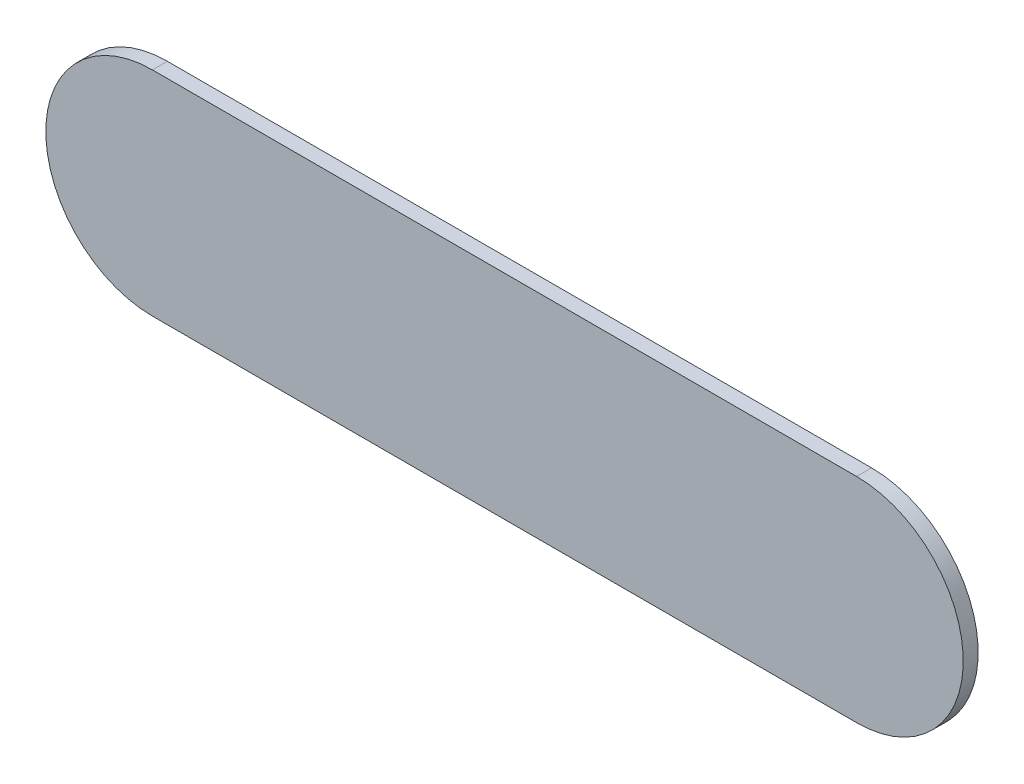
ISO-10303-21;
HEADER;
FILE_DESCRIPTION(('STEP AP214'),'2;1');
FILE_NAME('part.step','',(''),(''),'','','');
FILE_SCHEMA(('AUTOMOTIVE_DESIGN { 1 0 10303 214 1 1 1 1 }'));
ENDSEC;
DATA;
#1=APPLICATION_CONTEXT('core data for automotive mechanical design processes');
#2=APPLICATION_PROTOCOL_DEFINITION('international standard','automotive_design',2000,#1);
#3=PRODUCT_CONTEXT('',#1,'mechanical');
#4=PRODUCT('Part','Part','',(#3));
#5=PRODUCT_RELATED_PRODUCT_CATEGORY('part','',(#4));
#6=PRODUCT_DEFINITION_FORMATION('','',#4);
#7=PRODUCT_DEFINITION_CONTEXT('part definition',#1,'design');
#8=PRODUCT_DEFINITION('design','',#6,#7);
#9=PRODUCT_DEFINITION_SHAPE('','',#8);
#10=(LENGTH_UNIT() NAMED_UNIT(*) SI_UNIT(.MILLI.,.METRE.));
#11=(NAMED_UNIT(*) PLANE_ANGLE_UNIT() SI_UNIT($,.RADIAN.));
#12=(NAMED_UNIT(*) SI_UNIT($,.STERADIAN.) SOLID_ANGLE_UNIT());
#13=UNCERTAINTY_MEASURE_WITH_UNIT(LENGTH_MEASURE(1.E-05),#10,'distance_accuracy_value','');
#14=(GEOMETRIC_REPRESENTATION_CONTEXT(3) GLOBAL_UNCERTAINTY_ASSIGNED_CONTEXT((#13)) GLOBAL_UNIT_ASSIGNED_CONTEXT((#10,
#11,#12)) REPRESENTATION_CONTEXT('',''));
#15=CARTESIAN_POINT('',(0.,0.,0.));
#16=DIRECTION('',(0.,0.,1.));
#17=DIRECTION('',(1.,0.,0.));
#18=AXIS2_PLACEMENT_3D('',#15,#16,#17);
#19=CARTESIAN_POINT('',(123.444,-99.945,0.));
#20=DIRECTION('',(0.,0.,1.));
#21=DIRECTION('',(1.,0.,0.));
#22=AXIS2_PLACEMENT_3D('',#19,#20,#21);
#23=PLANE('',#22);
#24=DIRECTION('',(1.,0.,0.));
#25=VECTOR('',#24,1.);
#26=CARTESIAN_POINT('',(123.444,-99.945,0.));
#27=LINE('',#26,#25);
#28=CARTESIAN_POINT('',(123.444,-99.945,0.));
#29=VERTEX_POINT('',#28);
#30=CARTESIAN_POINT('',(125.095,-99.945,0.));
#31=VERTEX_POINT('',#30);
#32=EDGE_CURVE('E70',#29,#31,#27,.T.);
#33=ORIENTED_EDGE('',*,*,#32,.T.);
#34=CARTESIAN_POINT('',(125.095,-99.695,0.));
#35=DIRECTION('',(0.,0.,1.));
#36=DIRECTION('',(0.,-1.,0.));
#37=AXIS2_PLACEMENT_3D('',#34,#35,#36);
#38=CIRCLE('',#37,0.25);
#39=CARTESIAN_POINT('',(125.095,-99.445,0.));
#40=VERTEX_POINT('',#39);
#41=EDGE_CURVE('E102',#31,#40,#38,.T.);
#42=ORIENTED_EDGE('',*,*,#41,.T.);
#43=DIRECTION('',(-1.,0.,0.));
#44=VECTOR('',#43,1.);
#45=CARTESIAN_POINT('',(125.095,-99.445,0.));
#46=LINE('',#45,#44);
#47=CARTESIAN_POINT('',(123.444,-99.445,0.));
#48=VERTEX_POINT('',#47);
#49=EDGE_CURVE('E72',#40,#48,#46,.T.);
#50=ORIENTED_EDGE('',*,*,#49,.T.);
#51=CARTESIAN_POINT('',(123.444,-99.695,0.));
#52=DIRECTION('',(0.,0.,1.));
#53=DIRECTION('',(0.,1.,0.));
#54=AXIS2_PLACEMENT_3D('',#51,#52,#53);
#55=CIRCLE('',#54,0.25);
#56=EDGE_CURVE('E11',#48,#29,#55,.T.);
#57=ORIENTED_EDGE('',*,*,#56,.T.);
#58=EDGE_LOOP('',(#33,#42,#50,#57));
#59=FACE_BOUND('',#58,.T.);
#60=ADVANCED_FACE('F17',(#59),#23,.T.);
#61=CARTESIAN_POINT('',(123.444,-99.945,-0.035));
#62=DIRECTION('',(0.,0.,1.));
#63=DIRECTION('',(1.,0.,0.));
#64=AXIS2_PLACEMENT_3D('',#61,#62,#63);
#65=PLANE('',#64);
#66=CARTESIAN_POINT('',(123.444,-99.695,-0.035));
#67=DIRECTION('',(0.,0.,1.));
#68=DIRECTION('',(0.,1.,0.));
#69=AXIS2_PLACEMENT_3D('',#66,#67,#68);
#70=CIRCLE('',#69,0.25);
#71=CARTESIAN_POINT('',(123.444,-99.445,-0.035));
#72=VERTEX_POINT('',#71);
#73=CARTESIAN_POINT('',(123.444,-99.945,-0.035));
#74=VERTEX_POINT('',#73);
#75=EDGE_CURVE('E25',#72,#74,#70,.T.);
#76=ORIENTED_EDGE('',*,*,#75,.F.);
#77=DIRECTION('',(-1.,0.,0.));
#78=VECTOR('',#77,1.);
#79=CARTESIAN_POINT('',(125.095,-99.445,-0.035));
#80=LINE('',#79,#78);
#81=CARTESIAN_POINT('',(125.095,-99.445,-0.035));
#82=VERTEX_POINT('',#81);
#83=EDGE_CURVE('E105',#82,#72,#80,.T.);
#84=ORIENTED_EDGE('',*,*,#83,.F.);
#85=CARTESIAN_POINT('',(125.095,-99.695,-0.035));
#86=DIRECTION('',(0.,0.,1.));
#87=DIRECTION('',(0.,-1.,0.));
#88=AXIS2_PLACEMENT_3D('',#85,#86,#87);
#89=CIRCLE('',#88,0.25);
#90=CARTESIAN_POINT('',(125.095,-99.945,-0.035));
#91=VERTEX_POINT('',#90);
#92=EDGE_CURVE('E80',#91,#82,#89,.T.);
#93=ORIENTED_EDGE('',*,*,#92,.F.);
#94=DIRECTION('',(1.,0.,0.));
#95=VECTOR('',#94,1.);
#96=CARTESIAN_POINT('',(123.444,-99.945,-0.035));
#97=LINE('',#96,#95);
#98=EDGE_CURVE('E91',#74,#91,#97,.T.);
#99=ORIENTED_EDGE('',*,*,#98,.F.);
#100=EDGE_LOOP('',(#76,#84,#93,#99));
#101=FACE_BOUND('',#100,.T.);
#102=ADVANCED_FACE('F152',(#101),#65,.F.);
#103=CARTESIAN_POINT('',(123.444,-99.695,-0.035));
#104=DIRECTION('',(0.,0.,-1.));
#105=DIRECTION('',(0.,1.,0.));
#106=AXIS2_PLACEMENT_3D('',#103,#104,#105);
#107=CYLINDRICAL_SURFACE('',#106,0.25);
#108=ORIENTED_EDGE('',*,*,#75,.T.);
#109=DIRECTION('',(0.,0.,1.));
#110=VECTOR('',#109,1.);
#111=CARTESIAN_POINT('',(123.444,-99.945,-0.035));
#112=LINE('',#111,#110);
#113=EDGE_CURVE('E75',#74,#29,#112,.T.);
#114=ORIENTED_EDGE('',*,*,#113,.T.);
#115=ORIENTED_EDGE('',*,*,#56,.F.);
#116=DIRECTION('',(0.,0.,1.));
#117=VECTOR('',#116,1.);
#118=CARTESIAN_POINT('',(123.444,-99.445,-0.035));
#119=LINE('',#118,#117);
#120=EDGE_CURVE('E109',#72,#48,#119,.T.);
#121=ORIENTED_EDGE('',*,*,#120,.F.);
#122=EDGE_LOOP('',(#108,#114,#115,#121));
#123=FACE_BOUND('',#122,.T.);
#124=ADVANCED_FACE('F76',(#123),#107,.T.);
#125=CARTESIAN_POINT('',(125.095,-99.445,-0.035));
#126=DIRECTION('',(0.,-1.,0.));
#127=DIRECTION('',(0.,0.,-1.));
#128=AXIS2_PLACEMENT_3D('',#125,#126,#127);
#129=PLANE('',#128);
#130=ORIENTED_EDGE('',*,*,#83,.T.);
#131=ORIENTED_EDGE('',*,*,#120,.T.);
#132=ORIENTED_EDGE('',*,*,#49,.F.);
#133=DIRECTION('',(0.,0.,1.));
#134=VECTOR('',#133,1.);
#135=CARTESIAN_POINT('',(125.095,-99.445,-0.035));
#136=LINE('',#135,#134);
#137=EDGE_CURVE('E98',#82,#40,#136,.T.);
#138=ORIENTED_EDGE('',*,*,#137,.F.);
#139=EDGE_LOOP('',(#130,#131,#132,#138));
#140=FACE_BOUND('',#139,.T.);
#141=ADVANCED_FACE('F157',(#140),#129,.F.);
#142=CARTESIAN_POINT('',(125.095,-99.695,-0.035));
#143=DIRECTION('',(0.,0.,-1.));
#144=DIRECTION('',(0.,-1.,0.));
#145=AXIS2_PLACEMENT_3D('',#142,#143,#144);
#146=CYLINDRICAL_SURFACE('',#145,0.25);
#147=ORIENTED_EDGE('',*,*,#92,.T.);
#148=ORIENTED_EDGE('',*,*,#137,.T.);
#149=ORIENTED_EDGE('',*,*,#41,.F.);
#150=DIRECTION('',(0.,0.,1.));
#151=VECTOR('',#150,1.);
#152=CARTESIAN_POINT('',(125.095,-99.945,-0.035));
#153=LINE('',#152,#151);
#154=EDGE_CURVE('E84',#91,#31,#153,.T.);
#155=ORIENTED_EDGE('',*,*,#154,.F.);
#156=EDGE_LOOP('',(#147,#148,#149,#155));
#157=FACE_BOUND('',#156,.T.);
#158=ADVANCED_FACE('F155',(#157),#146,.T.);
#159=CARTESIAN_POINT('',(123.444,-99.945,-0.035));
#160=DIRECTION('',(0.,1.,0.));
#161=DIRECTION('',(1.,0.,0.));
#162=AXIS2_PLACEMENT_3D('',#159,#160,#161);
#163=PLANE('',#162);
#164=ORIENTED_EDGE('',*,*,#98,.T.);
#165=ORIENTED_EDGE('',*,*,#154,.T.);
#166=ORIENTED_EDGE('',*,*,#32,.F.);
#167=ORIENTED_EDGE('',*,*,#113,.F.);
#168=EDGE_LOOP('',(#164,#165,#166,#167));
#169=FACE_BOUND('',#168,.T.);
#170=ADVANCED_FACE('F82',(#169),#163,.F.);
#171=CLOSED_SHELL('',(#60,#102,#124,#141,#158,#170));
#172=MANIFOLD_SOLID_BREP('B1',#171);
#173=ADVANCED_BREP_SHAPE_REPRESENTATION('',(#18,#172),#14);
#174=SHAPE_DEFINITION_REPRESENTATION(#9,#173);
ENDSEC;
END-ISO-10303-21;
